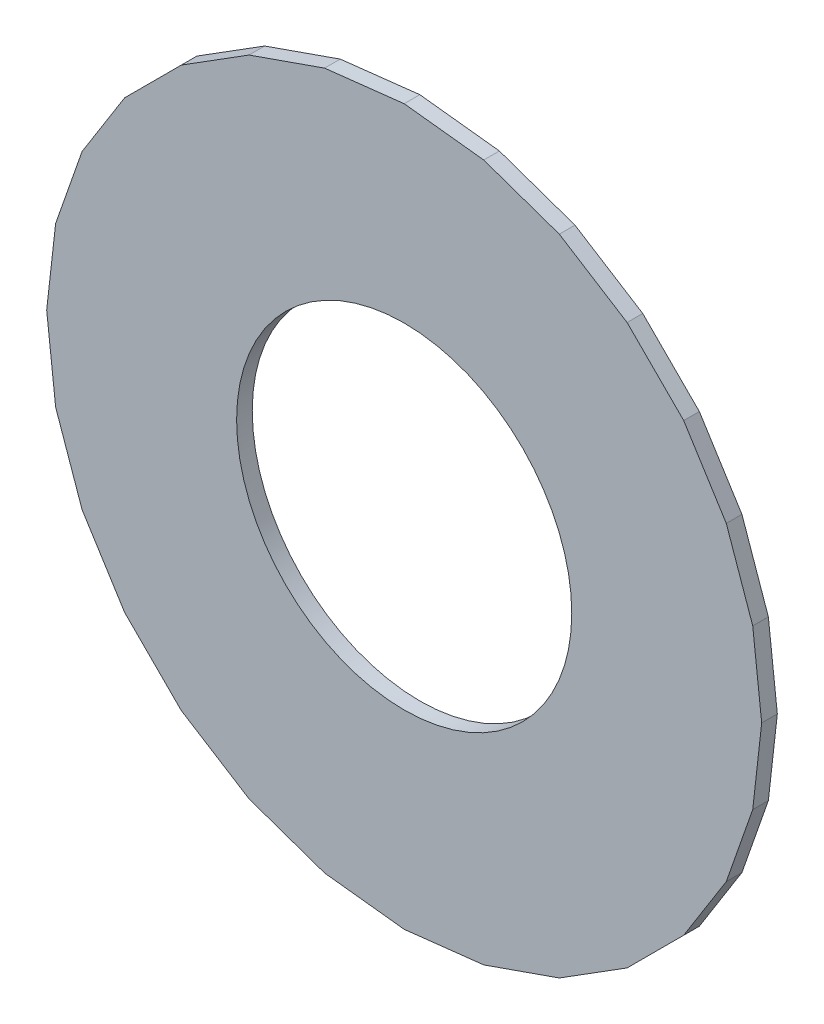
ISO-10303-21;
HEADER;
FILE_DESCRIPTION(('STEP AP214'),'2;1');
FILE_NAME('part.step','',(''),(''),'','','');
FILE_SCHEMA(('AUTOMOTIVE_DESIGN { 1 0 10303 214 1 1 1 1 }'));
ENDSEC;
DATA;
#1=APPLICATION_CONTEXT('core data for automotive mechanical design processes');
#2=APPLICATION_PROTOCOL_DEFINITION('international standard','automotive_design',2000,#1);
#3=PRODUCT_CONTEXT('',#1,'mechanical');
#4=PRODUCT('Part','Part','',(#3));
#5=PRODUCT_RELATED_PRODUCT_CATEGORY('part','',(#4));
#6=PRODUCT_DEFINITION_FORMATION('','',#4);
#7=PRODUCT_DEFINITION_CONTEXT('part definition',#1,'design');
#8=PRODUCT_DEFINITION('design','',#6,#7);
#9=PRODUCT_DEFINITION_SHAPE('','',#8);
#10=(LENGTH_UNIT() NAMED_UNIT(*) SI_UNIT(.MILLI.,.METRE.));
#11=(NAMED_UNIT(*) PLANE_ANGLE_UNIT() SI_UNIT($,.RADIAN.));
#12=(NAMED_UNIT(*) SI_UNIT($,.STERADIAN.) SOLID_ANGLE_UNIT());
#13=UNCERTAINTY_MEASURE_WITH_UNIT(LENGTH_MEASURE(1.E-05),#10,'distance_accuracy_value','');
#14=(GEOMETRIC_REPRESENTATION_CONTEXT(3) GLOBAL_UNCERTAINTY_ASSIGNED_CONTEXT((#13)) GLOBAL_UNIT_ASSIGNED_CONTEXT((#10,
#11,#12)) REPRESENTATION_CONTEXT('',''));
#15=CARTESIAN_POINT('',(0.,0.,0.));
#16=DIRECTION('',(0.,0.,1.));
#17=DIRECTION('',(1.,0.,0.));
#18=AXIS2_PLACEMENT_3D('',#15,#16,#17);
#19=CARTESIAN_POINT('',(117.856,-127.896,-0.045));
#20=DIRECTION('',(0.,0.,-1.));
#21=DIRECTION('',(0.,-1.,0.));
#22=AXIS2_PLACEMENT_3D('',#19,#20,#21);
#23=CYLINDRICAL_SURFACE('',#22,0.375);
#24=CARTESIAN_POINT('',(117.856,-127.896,-0.035));
#25=DIRECTION('',(0.,0.,-1.));
#26=DIRECTION('',(0.,-1.,0.));
#27=AXIS2_PLACEMENT_3D('',#24,#25,#26);
#28=CIRCLE('',#27,0.375);
#29=CARTESIAN_POINT('',(117.856,-128.271,-0.035));
#30=VERTEX_POINT('',#29);
#31=EDGE_CURVE('E385',#30,#30,#28,.T.);
#32=ORIENTED_EDGE('',*,*,#31,.T.);
#33=DIRECTION('',(0.,0.,1.));
#34=VECTOR('',#33,1.);
#35=CARTESIAN_POINT('',(117.856,-128.271,-0.045));
#36=LINE('',#35,#34);
#37=CARTESIAN_POINT('',(117.856,-128.271,0.));
#38=VERTEX_POINT('',#37);
#39=EDGE_CURVE('E11',#30,#38,#36,.T.);
#40=ORIENTED_EDGE('',*,*,#39,.T.);
#41=CARTESIAN_POINT('',(117.856,-127.896,0.));
#42=DIRECTION('',(0.,0.,-1.));
#43=DIRECTION('',(0.,-1.,0.));
#44=AXIS2_PLACEMENT_3D('',#41,#42,#43);
#45=CIRCLE('',#44,0.375);
#46=EDGE_CURVE('E306',#38,#38,#45,.T.);
#47=ORIENTED_EDGE('',*,*,#46,.F.);
#48=ORIENTED_EDGE('',*,*,#39,.F.);
#49=EDGE_LOOP('',(#32,#40,#47,#48));
#50=FACE_BOUND('',#49,.T.);
#51=ADVANCED_FACE('F17',(#50),#23,.F.);
#52=CARTESIAN_POINT('',(117.677983,-128.675942,-0.035));
#53=DIRECTION('',(-0.330278315977027,-0.943883591337077,0.));
#54=DIRECTION('',(-0.943883591337077,0.330278315977027,0.));
#55=AXIS2_PLACEMENT_3D('',#52,#53,#54);
#56=PLANE('',#55);
#57=DIRECTION('',(0.,0.,1.));
#58=VECTOR('',#57,1.);
#59=CARTESIAN_POINT('',(117.677983,-128.675942,-0.035));
#60=LINE('',#59,#58);
#61=CARTESIAN_POINT('',(117.677983,-128.675942,-0.035));
#62=VERTEX_POINT('',#61);
#63=CARTESIAN_POINT('',(117.677983,-128.675942,0.));
#64=VERTEX_POINT('',#63);
#65=EDGE_CURVE('E21',#62,#64,#60,.T.);
#66=ORIENTED_EDGE('',*,*,#65,.T.);
#67=DIRECTION('',(-0.943883591337077,0.330278315977027,0.));
#68=VECTOR('',#67,1.);
#69=CARTESIAN_POINT('',(117.677983,-128.675942,0.));
#70=LINE('',#69,#68);
#71=CARTESIAN_POINT('',(117.508893,-128.616775,0.));
#72=VERTEX_POINT('',#71);
#73=EDGE_CURVE('E460',#64,#72,#70,.T.);
#74=ORIENTED_EDGE('',*,*,#73,.T.);
#75=DIRECTION('',(0.,0.,1.));
#76=VECTOR('',#75,1.);
#77=CARTESIAN_POINT('',(117.508893,-128.616775,-0.035));
#78=LINE('',#77,#76);
#79=CARTESIAN_POINT('',(117.508893,-128.616775,-0.035));
#80=VERTEX_POINT('',#79);
#81=EDGE_CURVE('E341',#80,#72,#78,.T.);
#82=ORIENTED_EDGE('',*,*,#81,.F.);
#83=DIRECTION('',(-0.943883591337077,0.330278315977027,0.));
#84=VECTOR('',#83,1.);
#85=CARTESIAN_POINT('',(117.677983,-128.675942,-0.035));
#86=LINE('',#85,#84);
#87=EDGE_CURVE('E365',#62,#80,#86,.T.);
#88=ORIENTED_EDGE('',*,*,#87,.F.);
#89=EDGE_LOOP('',(#66,#74,#82,#88));
#90=FACE_BOUND('',#89,.T.);
#91=ADVANCED_FACE('F19',(#90),#56,.T.);
#92=CARTESIAN_POINT('',(117.856,-128.696,-0.035));
#93=DIRECTION('',(-0.111966136678988,-0.993712022789894,0.));
#94=DIRECTION('',(-0.993712022789894,0.111966136678988,0.));
#95=AXIS2_PLACEMENT_3D('',#92,#93,#94);
#96=PLANE('',#95);
#97=DIRECTION('',(0.,0.,1.));
#98=VECTOR('',#97,1.);
#99=CARTESIAN_POINT('',(117.856,-128.696,-0.035));
#100=LINE('',#99,#98);
#101=CARTESIAN_POINT('',(117.856,-128.696,-0.035));
#102=VERTEX_POINT('',#101);
#103=CARTESIAN_POINT('',(117.856,-128.696,0.));
#104=VERTEX_POINT('',#103);
#105=EDGE_CURVE('E343',#102,#104,#100,.T.);
#106=ORIENTED_EDGE('',*,*,#105,.T.);
#107=DIRECTION('',(-0.993712022789894,0.111966136678988,0.));
#108=VECTOR('',#107,1.);
#109=CARTESIAN_POINT('',(117.856,-128.696,0.));
#110=LINE('',#109,#108);
#111=EDGE_CURVE('E462',#104,#64,#110,.T.);
#112=ORIENTED_EDGE('',*,*,#111,.T.);
#113=ORIENTED_EDGE('',*,*,#65,.F.);
#114=DIRECTION('',(-0.993712022789894,0.111966136678988,0.));
#115=VECTOR('',#114,1.);
#116=CARTESIAN_POINT('',(117.856,-128.696,-0.035));
#117=LINE('',#116,#115);
#118=EDGE_CURVE('E483',#102,#62,#117,.T.);
#119=ORIENTED_EDGE('',*,*,#118,.F.);
#120=EDGE_LOOP('',(#106,#112,#113,#119));
#121=FACE_BOUND('',#120,.T.);
#122=ADVANCED_FACE('F482',(#121),#96,.T.);
#123=CARTESIAN_POINT('',(117.508893,-128.616775,-0.035));
#124=DIRECTION('',(-0.532032066600227,-0.846724205458361,0.));
#125=DIRECTION('',(-0.846724205458361,0.532032066600227,0.));
#126=AXIS2_PLACEMENT_3D('',#123,#124,#125);
#127=PLANE('',#126);
#128=ORIENTED_EDGE('',*,*,#81,.T.);
#129=DIRECTION('',(-0.846724205458361,0.532032066600227,0.));
#130=VECTOR('',#129,1.);
#131=CARTESIAN_POINT('',(117.508893,-128.616775,0.));
#132=LINE('',#131,#130);
#133=CARTESIAN_POINT('',(117.357208,-128.521465,0.));
#134=VERTEX_POINT('',#133);
#135=EDGE_CURVE('E457',#72,#134,#132,.T.);
#136=ORIENTED_EDGE('',*,*,#135,.T.);
#137=DIRECTION('',(0.,0.,1.));
#138=VECTOR('',#137,1.);
#139=CARTESIAN_POINT('',(117.357208,-128.521465,-0.035));
#140=LINE('',#139,#138);
#141=CARTESIAN_POINT('',(117.357208,-128.521465,-0.035));
#142=VERTEX_POINT('',#141);
#143=EDGE_CURVE('E352',#142,#134,#140,.T.);
#144=ORIENTED_EDGE('',*,*,#143,.F.);
#145=DIRECTION('',(-0.846724205458361,0.532032066600227,0.));
#146=VECTOR('',#145,1.);
#147=CARTESIAN_POINT('',(117.508893,-128.616775,-0.035));
#148=LINE('',#147,#146);
#149=EDGE_CURVE('E373',#80,#142,#148,.T.);
#150=ORIENTED_EDGE('',*,*,#149,.F.);
#151=EDGE_LOOP('',(#128,#136,#144,#150));
#152=FACE_BOUND('',#151,.T.);
#153=ADVANCED_FACE('F673',(#152),#127,.T.);
#154=CARTESIAN_POINT('',(118.034017,-128.675942,-0.035));
#155=DIRECTION('',(0.111966136678988,-0.993712022789894,0.));
#156=DIRECTION('',(0.,0.,-1.));
#157=AXIS2_PLACEMENT_3D('',#154,#155,#156);
#158=PLANE('',#157);
#159=DIRECTION('',(0.,0.,1.));
#160=VECTOR('',#159,1.);
#161=CARTESIAN_POINT('',(118.034017,-128.675942,-0.035));
#162=LINE('',#161,#160);
#163=CARTESIAN_POINT('',(118.034017,-128.675942,-0.035));
#164=VERTEX_POINT('',#163);
#165=CARTESIAN_POINT('',(118.034017,-128.675942,0.));
#166=VERTEX_POINT('',#165);
#167=EDGE_CURVE('E361',#164,#166,#162,.T.);
#168=ORIENTED_EDGE('',*,*,#167,.T.);
#169=DIRECTION('',(-0.993712022789894,-0.111966136678988,0.));
#170=VECTOR('',#169,1.);
#171=CARTESIAN_POINT('',(118.034017,-128.675942,0.));
#172=LINE('',#171,#170);
#173=EDGE_CURVE('E282',#166,#104,#172,.T.);
#174=ORIENTED_EDGE('',*,*,#173,.T.);
#175=ORIENTED_EDGE('',*,*,#105,.F.);
#176=DIRECTION('',(-0.993712022789894,-0.111966136678988,0.));
#177=VECTOR('',#176,1.);
#178=CARTESIAN_POINT('',(118.034017,-128.675942,-0.035));
#179=LINE('',#178,#177);
#180=EDGE_CURVE('E487',#164,#102,#179,.T.);
#181=ORIENTED_EDGE('',*,*,#180,.F.);
#182=EDGE_LOOP('',(#168,#174,#175,#181));
#183=FACE_BOUND('',#182,.T.);
#184=ADVANCED_FACE('F473',(#183),#158,.T.);
#185=CARTESIAN_POINT('',(117.357208,-128.521465,-0.035));
#186=DIRECTION('',(-0.707106781186548,-0.707106781186548,0.));
#187=DIRECTION('',(-0.707106781186548,0.707106781186548,0.));
#188=AXIS2_PLACEMENT_3D('',#185,#186,#187);
#189=PLANE('',#188);
#190=ORIENTED_EDGE('',*,*,#143,.T.);
#191=DIRECTION('',(-0.707106781186548,0.707106781186548,0.));
#192=VECTOR('',#191,1.);
#193=CARTESIAN_POINT('',(117.357208,-128.521465,0.));
#194=LINE('',#193,#192);
#195=CARTESIAN_POINT('',(117.230535,-128.394792,0.));
#196=VERTEX_POINT('',#195);
#197=EDGE_CURVE('E434',#134,#196,#194,.T.);
#198=ORIENTED_EDGE('',*,*,#197,.T.);
#199=DIRECTION('',(0.,0.,1.));
#200=VECTOR('',#199,1.);
#201=CARTESIAN_POINT('',(117.230535,-128.394792,-0.035));
#202=LINE('',#201,#200);
#203=CARTESIAN_POINT('',(117.230535,-128.394792,-0.035));
#204=VERTEX_POINT('',#203);
#205=EDGE_CURVE('E394',#204,#196,#202,.T.);
#206=ORIENTED_EDGE('',*,*,#205,.F.);
#207=DIRECTION('',(-0.707106781186548,0.707106781186548,0.));
#208=VECTOR('',#207,1.);
#209=CARTESIAN_POINT('',(117.357208,-128.521465,-0.035));
#210=LINE('',#209,#208);
#211=EDGE_CURVE('E377',#142,#204,#210,.T.);
#212=ORIENTED_EDGE('',*,*,#211,.F.);
#213=EDGE_LOOP('',(#190,#198,#206,#212));
#214=FACE_BOUND('',#213,.T.);
#215=ADVANCED_FACE('F684',(#214),#189,.T.);
#216=CARTESIAN_POINT('',(118.203107,-128.616775,-0.035));
#217=DIRECTION('',(0.330278315977027,-0.943883591337077,0.));
#218=DIRECTION('',(0.,0.,-1.));
#219=AXIS2_PLACEMENT_3D('',#216,#217,#218);
#220=PLANE('',#219);
#221=DIRECTION('',(0.,0.,1.));
#222=VECTOR('',#221,1.);
#223=CARTESIAN_POINT('',(118.203107,-128.616775,-0.035));
#224=LINE('',#223,#222);
#225=CARTESIAN_POINT('',(118.203107,-128.616775,-0.035));
#226=VERTEX_POINT('',#225);
#227=CARTESIAN_POINT('',(118.203107,-128.616775,0.));
#228=VERTEX_POINT('',#227);
#229=EDGE_CURVE('E391',#226,#228,#224,.T.);
#230=ORIENTED_EDGE('',*,*,#229,.T.);
#231=DIRECTION('',(-0.943883591337077,-0.330278315977027,0.));
#232=VECTOR('',#231,1.);
#233=CARTESIAN_POINT('',(118.203107,-128.616775,0.));
#234=LINE('',#233,#232);
#235=EDGE_CURVE('E284',#228,#166,#234,.T.);
#236=ORIENTED_EDGE('',*,*,#235,.T.);
#237=ORIENTED_EDGE('',*,*,#167,.F.);
#238=DIRECTION('',(-0.943883591337077,-0.330278315977027,0.));
#239=VECTOR('',#238,1.);
#240=CARTESIAN_POINT('',(118.203107,-128.616775,-0.035));
#241=LINE('',#240,#239);
#242=EDGE_CURVE('E493',#226,#164,#241,.T.);
#243=ORIENTED_EDGE('',*,*,#242,.F.);
#244=EDGE_LOOP('',(#230,#236,#237,#243));
#245=FACE_BOUND('',#244,.T.);
#246=ADVANCED_FACE('F635',(#245),#220,.T.);
#247=CARTESIAN_POINT('',(117.230535,-128.394792,-0.035));
#248=DIRECTION('',(-0.846724205458361,-0.532032066600227,0.));
#249=DIRECTION('',(-0.532032066600227,0.846724205458361,0.));
#250=AXIS2_PLACEMENT_3D('',#247,#248,#249);
#251=PLANE('',#250);
#252=ORIENTED_EDGE('',*,*,#205,.T.);
#253=DIRECTION('',(-0.532032066600227,0.846724205458361,0.));
#254=VECTOR('',#253,1.);
#255=CARTESIAN_POINT('',(117.230535,-128.394792,0.));
#256=LINE('',#255,#254);
#257=CARTESIAN_POINT('',(117.135225,-128.243107,0.));
#258=VERTEX_POINT('',#257);
#259=EDGE_CURVE('E430',#196,#258,#256,.T.);
#260=ORIENTED_EDGE('',*,*,#259,.T.);
#261=DIRECTION('',(0.,0.,1.));
#262=VECTOR('',#261,1.);
#263=CARTESIAN_POINT('',(117.135225,-128.243107,-0.035));
#264=LINE('',#263,#262);
#265=CARTESIAN_POINT('',(117.135225,-128.243107,-0.035));
#266=VERTEX_POINT('',#265);
#267=EDGE_CURVE('E331',#266,#258,#264,.T.);
#268=ORIENTED_EDGE('',*,*,#267,.F.);
#269=DIRECTION('',(-0.532032066600227,0.846724205458361,0.));
#270=VECTOR('',#269,1.);
#271=CARTESIAN_POINT('',(117.230535,-128.394792,-0.035));
#272=LINE('',#271,#270);
#273=EDGE_CURVE('E390',#204,#266,#272,.T.);
#274=ORIENTED_EDGE('',*,*,#273,.F.);
#275=EDGE_LOOP('',(#252,#260,#268,#274));
#276=FACE_BOUND('',#275,.T.);
#277=ADVANCED_FACE('F697',(#276),#251,.T.);
#278=CARTESIAN_POINT('',(118.354792,-128.521465,-0.035));
#279=DIRECTION('',(0.532032066600227,-0.846724205458361,0.));
#280=DIRECTION('',(0.,0.,-1.));
#281=AXIS2_PLACEMENT_3D('',#278,#279,#280);
#282=PLANE('',#281);
#283=DIRECTION('',(0.,0.,1.));
#284=VECTOR('',#283,1.);
#285=CARTESIAN_POINT('',(118.354792,-128.521465,-0.035));
#286=LINE('',#285,#284);
#287=CARTESIAN_POINT('',(118.354792,-128.521465,-0.035));
#288=VERTEX_POINT('',#287);
#289=CARTESIAN_POINT('',(118.354792,-128.521465,0.));
#290=VERTEX_POINT('',#289);
#291=EDGE_CURVE('E327',#288,#290,#286,.T.);
#292=ORIENTED_EDGE('',*,*,#291,.T.);
#293=DIRECTION('',(-0.846724205458361,-0.532032066600227,0.));
#294=VECTOR('',#293,1.);
#295=CARTESIAN_POINT('',(118.354792,-128.521465,0.));
#296=LINE('',#295,#294);
#297=EDGE_CURVE('E288',#290,#228,#296,.T.);
#298=ORIENTED_EDGE('',*,*,#297,.T.);
#299=ORIENTED_EDGE('',*,*,#229,.F.);
#300=DIRECTION('',(-0.846724205458361,-0.532032066600227,0.));
#301=VECTOR('',#300,1.);
#302=CARTESIAN_POINT('',(118.354792,-128.521465,-0.035));
#303=LINE('',#302,#301);
#304=EDGE_CURVE('E499',#288,#226,#303,.T.);
#305=ORIENTED_EDGE('',*,*,#304,.F.);
#306=EDGE_LOOP('',(#292,#298,#299,#305));
#307=FACE_BOUND('',#306,.T.);
#308=ADVANCED_FACE('F633',(#307),#282,.T.);
#309=CARTESIAN_POINT('',(117.135225,-128.243107,-0.035));
#310=DIRECTION('',(-0.943883591337077,-0.330278315977027,0.));
#311=DIRECTION('',(-0.330278315977027,0.943883591337077,0.));
#312=AXIS2_PLACEMENT_3D('',#309,#310,#311);
#313=PLANE('',#312);
#314=ORIENTED_EDGE('',*,*,#267,.T.);
#315=DIRECTION('',(-0.330278315977027,0.943883591337077,0.));
#316=VECTOR('',#315,1.);
#317=CARTESIAN_POINT('',(117.135225,-128.243107,0.));
#318=LINE('',#317,#316);
#319=CARTESIAN_POINT('',(117.076058,-128.074017,0.));
#320=VERTEX_POINT('',#319);
#321=EDGE_CURVE('E435',#258,#320,#318,.T.);
#322=ORIENTED_EDGE('',*,*,#321,.T.);
#323=DIRECTION('',(0.,0.,1.));
#324=VECTOR('',#323,1.);
#325=CARTESIAN_POINT('',(117.076058,-128.074017,-0.035));
#326=LINE('',#325,#324);
#327=CARTESIAN_POINT('',(117.076058,-128.074017,-0.035));
#328=VERTEX_POINT('',#327);
#329=EDGE_CURVE('E310',#328,#320,#326,.T.);
#330=ORIENTED_EDGE('',*,*,#329,.F.);
#331=DIRECTION('',(-0.330278315977027,0.943883591337077,0.));
#332=VECTOR('',#331,1.);
#333=CARTESIAN_POINT('',(117.135225,-128.243107,-0.035));
#334=LINE('',#333,#332);
#335=EDGE_CURVE('E398',#266,#328,#334,.T.);
#336=ORIENTED_EDGE('',*,*,#335,.F.);
#337=EDGE_LOOP('',(#314,#322,#330,#336));
#338=FACE_BOUND('',#337,.T.);
#339=ADVANCED_FACE('F713',(#338),#313,.T.);
#340=CARTESIAN_POINT('',(118.481465,-128.394792,-0.035));
#341=DIRECTION('',(0.707106781186548,-0.707106781186548,0.));
#342=DIRECTION('',(0.,0.,-1.));
#343=AXIS2_PLACEMENT_3D('',#340,#341,#342);
#344=PLANE('',#343);
#345=DIRECTION('',(0.,0.,1.));
#346=VECTOR('',#345,1.);
#347=CARTESIAN_POINT('',(118.481465,-128.394792,-0.035));
#348=LINE('',#347,#346);
#349=CARTESIAN_POINT('',(118.481465,-128.394792,-0.035));
#350=VERTEX_POINT('',#349);
#351=CARTESIAN_POINT('',(118.481465,-128.394792,0.));
#352=VERTEX_POINT('',#351);
#353=EDGE_CURVE('E307',#350,#352,#348,.T.);
#354=ORIENTED_EDGE('',*,*,#353,.T.);
#355=DIRECTION('',(-0.707106781186548,-0.707106781186548,0.));
#356=VECTOR('',#355,1.);
#357=CARTESIAN_POINT('',(118.481465,-128.394792,0.));
#358=LINE('',#357,#356);
#359=EDGE_CURVE('E293',#352,#290,#358,.T.);
#360=ORIENTED_EDGE('',*,*,#359,.T.);
#361=ORIENTED_EDGE('',*,*,#291,.F.);
#362=DIRECTION('',(-0.707106781186548,-0.707106781186548,0.));
#363=VECTOR('',#362,1.);
#364=CARTESIAN_POINT('',(118.481465,-128.394792,-0.035));
#365=LINE('',#364,#363);
#366=EDGE_CURVE('E504',#350,#288,#365,.T.);
#367=ORIENTED_EDGE('',*,*,#366,.F.);
#368=EDGE_LOOP('',(#354,#360,#361,#367));
#369=FACE_BOUND('',#368,.T.);
#370=ADVANCED_FACE('F629',(#369),#344,.T.);
#371=CARTESIAN_POINT('',(117.076058,-128.074017,-0.035));
#372=DIRECTION('',(-0.993712022789894,-0.111966136678988,0.));
#373=DIRECTION('',(-0.111966136678988,0.993712022789894,0.));
#374=AXIS2_PLACEMENT_3D('',#371,#372,#373);
#375=PLANE('',#374);
#376=ORIENTED_EDGE('',*,*,#329,.T.);
#377=DIRECTION('',(-0.111966136678988,0.993712022789894,0.));
#378=VECTOR('',#377,1.);
#379=CARTESIAN_POINT('',(117.076058,-128.074017,0.));
#380=LINE('',#379,#378);
#381=CARTESIAN_POINT('',(117.056,-127.896,0.));
#382=VERTEX_POINT('',#381);
#383=EDGE_CURVE('E371',#320,#382,#380,.T.);
#384=ORIENTED_EDGE('',*,*,#383,.T.);
#385=DIRECTION('',(0.,0.,1.));
#386=VECTOR('',#385,1.);
#387=CARTESIAN_POINT('',(117.056,-127.896,-0.035));
#388=LINE('',#387,#386);
#389=CARTESIAN_POINT('',(117.056,-127.896,-0.035));
#390=VERTEX_POINT('',#389);
#391=EDGE_CURVE('E311',#390,#382,#388,.T.);
#392=ORIENTED_EDGE('',*,*,#391,.F.);
#393=DIRECTION('',(-0.111966136678988,0.993712022789894,0.));
#394=VECTOR('',#393,1.);
#395=CARTESIAN_POINT('',(117.076058,-128.074017,-0.035));
#396=LINE('',#395,#394);
#397=EDGE_CURVE('E399',#328,#390,#396,.T.);
#398=ORIENTED_EDGE('',*,*,#397,.F.);
#399=EDGE_LOOP('',(#376,#384,#392,#398));
#400=FACE_BOUND('',#399,.T.);
#401=ADVANCED_FACE('F729',(#400),#375,.T.);
#402=CARTESIAN_POINT('',(118.576775,-128.243107,-0.035));
#403=DIRECTION('',(0.846724205458361,-0.532032066600227,0.));
#404=DIRECTION('',(0.,0.,-1.));
#405=AXIS2_PLACEMENT_3D('',#402,#403,#404);
#406=PLANE('',#405);
#407=DIRECTION('',(0.,0.,1.));
#408=VECTOR('',#407,1.);
#409=CARTESIAN_POINT('',(118.576775,-128.243107,-0.035));
#410=LINE('',#409,#408);
#411=CARTESIAN_POINT('',(118.576775,-128.243107,-0.035));
#412=VERTEX_POINT('',#411);
#413=CARTESIAN_POINT('',(118.576775,-128.243107,0.));
#414=VERTEX_POINT('',#413);
#415=EDGE_CURVE('E340',#412,#414,#410,.T.);
#416=ORIENTED_EDGE('',*,*,#415,.T.);
#417=DIRECTION('',(-0.532032066600227,-0.846724205458361,0.));
#418=VECTOR('',#417,1.);
#419=CARTESIAN_POINT('',(118.576775,-128.243107,0.));
#420=LINE('',#419,#418);
#421=EDGE_CURVE('E289',#414,#352,#420,.T.);
#422=ORIENTED_EDGE('',*,*,#421,.T.);
#423=ORIENTED_EDGE('',*,*,#353,.F.);
#424=DIRECTION('',(-0.532032066600227,-0.846724205458361,0.));
#425=VECTOR('',#424,1.);
#426=CARTESIAN_POINT('',(118.576775,-128.243107,-0.035));
#427=LINE('',#426,#425);
#428=EDGE_CURVE('E508',#412,#350,#427,.T.);
#429=ORIENTED_EDGE('',*,*,#428,.F.);
#430=EDGE_LOOP('',(#416,#422,#423,#429));
#431=FACE_BOUND('',#430,.T.);
#432=ADVANCED_FACE('F625',(#431),#406,.T.);
#433=CARTESIAN_POINT('',(117.056,-127.896,-0.035));
#434=DIRECTION('',(-0.993712022789894,0.111966136678988,0.));
#435=DIRECTION('',(0.,0.,1.));
#436=AXIS2_PLACEMENT_3D('',#433,#434,#435);
#437=PLANE('',#436);
#438=ORIENTED_EDGE('',*,*,#391,.T.);
#439=DIRECTION('',(0.111966136678988,0.993712022789894,0.));
#440=VECTOR('',#439,1.);
#441=CARTESIAN_POINT('',(117.056,-127.896,0.));
#442=LINE('',#441,#440);
#443=CARTESIAN_POINT('',(117.076058,-127.717983,0.));
#444=VERTEX_POINT('',#443);
#445=EDGE_CURVE('E367',#382,#444,#442,.T.);
#446=ORIENTED_EDGE('',*,*,#445,.T.);
#447=DIRECTION('',(0.,0.,1.));
#448=VECTOR('',#447,1.);
#449=CARTESIAN_POINT('',(117.076058,-127.717983,-0.035));
#450=LINE('',#449,#448);
#451=CARTESIAN_POINT('',(117.076058,-127.717983,-0.035));
#452=VERTEX_POINT('',#451);
#453=EDGE_CURVE('E338',#452,#444,#450,.T.);
#454=ORIENTED_EDGE('',*,*,#453,.F.);
#455=DIRECTION('',(0.111966136678988,0.993712022789894,0.));
#456=VECTOR('',#455,1.);
#457=CARTESIAN_POINT('',(117.056,-127.896,-0.035));
#458=LINE('',#457,#456);
#459=EDGE_CURVE('E403',#390,#452,#458,.T.);
#460=ORIENTED_EDGE('',*,*,#459,.F.);
#461=EDGE_LOOP('',(#438,#446,#454,#460));
#462=FACE_BOUND('',#461,.T.);
#463=ADVANCED_FACE('F745',(#462),#437,.T.);
#464=CARTESIAN_POINT('',(118.635942,-128.074017,-0.035));
#465=DIRECTION('',(0.943883591337077,-0.330278315977027,0.));
#466=DIRECTION('',(0.,0.,-1.));
#467=AXIS2_PLACEMENT_3D('',#464,#465,#466);
#468=PLANE('',#467);
#469=DIRECTION('',(0.,0.,1.));
#470=VECTOR('',#469,1.);
#471=CARTESIAN_POINT('',(118.635942,-128.074017,-0.035));
#472=LINE('',#471,#470);
#473=CARTESIAN_POINT('',(118.635942,-128.074017,-0.035));
#474=VERTEX_POINT('',#473);
#475=CARTESIAN_POINT('',(118.635942,-128.074017,0.));
#476=VERTEX_POINT('',#475);
#477=EDGE_CURVE('E335',#474,#476,#472,.T.);
#478=ORIENTED_EDGE('',*,*,#477,.T.);
#479=DIRECTION('',(-0.330278315977027,-0.943883591337077,0.));
#480=VECTOR('',#479,1.);
#481=CARTESIAN_POINT('',(118.635942,-128.074017,0.));
#482=LINE('',#481,#480);
#483=EDGE_CURVE('E278',#476,#414,#482,.T.);
#484=ORIENTED_EDGE('',*,*,#483,.T.);
#485=ORIENTED_EDGE('',*,*,#415,.F.);
#486=DIRECTION('',(-0.330278315977027,-0.943883591337077,0.));
#487=VECTOR('',#486,1.);
#488=CARTESIAN_POINT('',(118.635942,-128.074017,-0.035));
#489=LINE('',#488,#487);
#490=EDGE_CURVE('E514',#474,#412,#489,.T.);
#491=ORIENTED_EDGE('',*,*,#490,.F.);
#492=EDGE_LOOP('',(#478,#484,#485,#491));
#493=FACE_BOUND('',#492,.T.);
#494=ADVANCED_FACE('F622',(#493),#468,.T.);
#495=CARTESIAN_POINT('',(117.076058,-127.717983,-0.035));
#496=DIRECTION('',(-0.943883591337077,0.330278315977027,0.));
#497=DIRECTION('',(0.,0.,1.));
#498=AXIS2_PLACEMENT_3D('',#495,#496,#497);
#499=PLANE('',#498);
#500=ORIENTED_EDGE('',*,*,#453,.T.);
#501=DIRECTION('',(0.330278315977027,0.943883591337077,0.));
#502=VECTOR('',#501,1.);
#503=CARTESIAN_POINT('',(117.076058,-127.717983,0.));
#504=LINE('',#503,#502);
#505=CARTESIAN_POINT('',(117.135225,-127.548893,0.));
#506=VERTEX_POINT('',#505);
#507=EDGE_CURVE('E372',#444,#506,#504,.T.);
#508=ORIENTED_EDGE('',*,*,#507,.T.);
#509=DIRECTION('',(0.,0.,1.));
#510=VECTOR('',#509,1.);
#511=CARTESIAN_POINT('',(117.135225,-127.548893,-0.035));
#512=LINE('',#511,#510);
#513=CARTESIAN_POINT('',(117.135225,-127.548893,-0.035));
#514=VERTEX_POINT('',#513);
#515=EDGE_CURVE('E332',#514,#506,#512,.T.);
#516=ORIENTED_EDGE('',*,*,#515,.F.);
#517=DIRECTION('',(0.330278315977027,0.943883591337077,0.));
#518=VECTOR('',#517,1.);
#519=CARTESIAN_POINT('',(117.076058,-127.717983,-0.035));
#520=LINE('',#519,#518);
#521=EDGE_CURVE('E552',#452,#514,#520,.T.);
#522=ORIENTED_EDGE('',*,*,#521,.F.);
#523=EDGE_LOOP('',(#500,#508,#516,#522));
#524=FACE_BOUND('',#523,.T.);
#525=ADVANCED_FACE('F761',(#524),#499,.T.);
#526=CARTESIAN_POINT('',(118.656,-127.896,-0.035));
#527=DIRECTION('',(0.993712022789894,-0.111966136678988,0.));
#528=DIRECTION('',(0.,0.,-1.));
#529=AXIS2_PLACEMENT_3D('',#526,#527,#528);
#530=PLANE('',#529);
#531=DIRECTION('',(0.,0.,1.));
#532=VECTOR('',#531,1.);
#533=CARTESIAN_POINT('',(118.656,-127.896,-0.035));
#534=LINE('',#533,#532);
#535=CARTESIAN_POINT('',(118.656,-127.896,-0.035));
#536=VERTEX_POINT('',#535);
#537=CARTESIAN_POINT('',(118.656,-127.896,0.));
#538=VERTEX_POINT('',#537);
#539=EDGE_CURVE('E326',#536,#538,#534,.T.);
#540=ORIENTED_EDGE('',*,*,#539,.T.);
#541=DIRECTION('',(-0.111966136678988,-0.993712022789894,0.));
#542=VECTOR('',#541,1.);
#543=CARTESIAN_POINT('',(118.656,-127.896,0.));
#544=LINE('',#543,#542);
#545=EDGE_CURVE('E271',#538,#476,#544,.T.);
#546=ORIENTED_EDGE('',*,*,#545,.T.);
#547=ORIENTED_EDGE('',*,*,#477,.F.);
#548=DIRECTION('',(-0.111966136678988,-0.993712022789894,0.));
#549=VECTOR('',#548,1.);
#550=CARTESIAN_POINT('',(118.656,-127.896,-0.035));
#551=LINE('',#550,#549);
#552=EDGE_CURVE('E517',#536,#474,#551,.T.);
#553=ORIENTED_EDGE('',*,*,#552,.F.);
#554=EDGE_LOOP('',(#540,#546,#547,#553));
#555=FACE_BOUND('',#554,.T.);
#556=ADVANCED_FACE('F793',(#555),#530,.T.);
#557=CARTESIAN_POINT('',(117.135225,-127.548893,-0.035));
#558=DIRECTION('',(-0.846724205458361,0.532032066600227,0.));
#559=DIRECTION('',(0.,0.,1.));
#560=AXIS2_PLACEMENT_3D('',#557,#558,#559);
#561=PLANE('',#560);
#562=ORIENTED_EDGE('',*,*,#515,.T.);
#563=DIRECTION('',(0.532032066600227,0.846724205458361,0.));
#564=VECTOR('',#563,1.);
#565=CARTESIAN_POINT('',(117.135225,-127.548893,0.));
#566=LINE('',#565,#564);
#567=CARTESIAN_POINT('',(117.230535,-127.397208,0.));
#568=VERTEX_POINT('',#567);
#569=EDGE_CURVE('E413',#506,#568,#566,.T.);
#570=ORIENTED_EDGE('',*,*,#569,.T.);
#571=DIRECTION('',(0.,0.,1.));
#572=VECTOR('',#571,1.);
#573=CARTESIAN_POINT('',(117.230535,-127.397208,-0.035));
#574=LINE('',#573,#572);
#575=CARTESIAN_POINT('',(117.230535,-127.397208,-0.035));
#576=VERTEX_POINT('',#575);
#577=EDGE_CURVE('E255',#576,#568,#574,.T.);
#578=ORIENTED_EDGE('',*,*,#577,.F.);
#579=DIRECTION('',(0.532032066600227,0.846724205458361,0.));
#580=VECTOR('',#579,1.);
#581=CARTESIAN_POINT('',(117.135225,-127.548893,-0.035));
#582=LINE('',#581,#580);
#583=EDGE_CURVE('E409',#514,#576,#582,.T.);
#584=ORIENTED_EDGE('',*,*,#583,.F.);
#585=EDGE_LOOP('',(#562,#570,#578,#584));
#586=FACE_BOUND('',#585,.T.);
#587=ADVANCED_FACE('F771',(#586),#561,.T.);
#588=CARTESIAN_POINT('',(118.635942,-127.717983,-0.035));
#589=DIRECTION('',(0.993712022789894,0.111966136678988,0.));
#590=DIRECTION('',(0.,0.,-1.));
#591=AXIS2_PLACEMENT_3D('',#588,#589,#590);
#592=PLANE('',#591);
#593=DIRECTION('',(0.,0.,1.));
#594=VECTOR('',#593,1.);
#595=CARTESIAN_POINT('',(118.635942,-127.717983,-0.035));
#596=LINE('',#595,#594);
#597=CARTESIAN_POINT('',(118.635942,-127.717983,-0.035));
#598=VERTEX_POINT('',#597);
#599=CARTESIAN_POINT('',(118.635942,-127.717983,0.));
#600=VERTEX_POINT('',#599);
#601=EDGE_CURVE('E242',#598,#600,#596,.T.);
#602=ORIENTED_EDGE('',*,*,#601,.T.);
#603=DIRECTION('',(0.111966136678988,-0.993712022789894,0.));
#604=VECTOR('',#603,1.);
#605=CARTESIAN_POINT('',(118.635942,-127.717983,0.));
#606=LINE('',#605,#604);
#607=EDGE_CURVE('E247',#600,#538,#606,.T.);
#608=ORIENTED_EDGE('',*,*,#607,.T.);
#609=ORIENTED_EDGE('',*,*,#539,.F.);
#610=DIRECTION('',(0.111966136678988,-0.993712022789894,0.));
#611=VECTOR('',#610,1.);
#612=CARTESIAN_POINT('',(118.635942,-127.717983,-0.035));
#613=LINE('',#612,#611);
#614=EDGE_CURVE('E250',#598,#536,#613,.T.);
#615=ORIENTED_EDGE('',*,*,#614,.F.);
#616=EDGE_LOOP('',(#602,#608,#609,#615));
#617=FACE_BOUND('',#616,.T.);
#618=ADVANCED_FACE('F244',(#617),#592,.T.);
#619=CARTESIAN_POINT('',(117.230535,-127.397208,-0.035));
#620=DIRECTION('',(-0.707106781186548,0.707106781186548,0.));
#621=DIRECTION('',(0.,0.,1.));
#622=AXIS2_PLACEMENT_3D('',#619,#620,#621);
#623=PLANE('',#622);
#624=ORIENTED_EDGE('',*,*,#577,.T.);
#625=DIRECTION('',(0.707106781186548,0.707106781186548,0.));
#626=VECTOR('',#625,1.);
#627=CARTESIAN_POINT('',(117.230535,-127.397208,0.));
#628=LINE('',#627,#626);
#629=CARTESIAN_POINT('',(117.357208,-127.270535,0.));
#630=VERTEX_POINT('',#629);
#631=EDGE_CURVE('E439',#568,#630,#628,.T.);
#632=ORIENTED_EDGE('',*,*,#631,.T.);
#633=DIRECTION('',(0.,0.,1.));
#634=VECTOR('',#633,1.);
#635=CARTESIAN_POINT('',(117.357208,-127.270535,-0.035));
#636=LINE('',#635,#634);
#637=CARTESIAN_POINT('',(117.357208,-127.270535,-0.035));
#638=VERTEX_POINT('',#637);
#639=EDGE_CURVE('E256',#638,#630,#636,.T.);
#640=ORIENTED_EDGE('',*,*,#639,.F.);
#641=DIRECTION('',(0.707106781186548,0.707106781186548,0.));
#642=VECTOR('',#641,1.);
#643=CARTESIAN_POINT('',(117.230535,-127.397208,-0.035));
#644=LINE('',#643,#642);
#645=EDGE_CURVE('E404',#576,#638,#644,.T.);
#646=ORIENTED_EDGE('',*,*,#645,.F.);
#647=EDGE_LOOP('',(#624,#632,#640,#646));
#648=FACE_BOUND('',#647,.T.);
#649=ADVANCED_FACE('F770',(#648),#623,.T.);
#650=CARTESIAN_POINT('',(118.576775,-127.548893,-0.035));
#651=DIRECTION('',(0.943883591337077,0.330278315977027,0.));
#652=DIRECTION('',(0.,0.,-1.));
#653=AXIS2_PLACEMENT_3D('',#650,#651,#652);
#654=PLANE('',#653);
#655=DIRECTION('',(0.,0.,1.));
#656=VECTOR('',#655,1.);
#657=CARTESIAN_POINT('',(118.576775,-127.548893,-0.035));
#658=LINE('',#657,#656);
#659=CARTESIAN_POINT('',(118.576775,-127.548893,-0.035));
#660=VERTEX_POINT('',#659);
#661=CARTESIAN_POINT('',(118.576775,-127.548893,0.));
#662=VERTEX_POINT('',#661);
#663=EDGE_CURVE('E261',#660,#662,#658,.T.);
#664=ORIENTED_EDGE('',*,*,#663,.T.);
#665=DIRECTION('',(0.330278315977027,-0.943883591337077,0.));
#666=VECTOR('',#665,1.);
#667=CARTESIAN_POINT('',(118.576775,-127.548893,0.));
#668=LINE('',#667,#666);
#669=EDGE_CURVE('E259',#662,#600,#668,.T.);
#670=ORIENTED_EDGE('',*,*,#669,.T.);
#671=ORIENTED_EDGE('',*,*,#601,.F.);
#672=DIRECTION('',(0.330278315977027,-0.943883591337077,0.));
#673=VECTOR('',#672,1.);
#674=CARTESIAN_POINT('',(118.576775,-127.548893,-0.035));
#675=LINE('',#674,#673);
#676=EDGE_CURVE('E523',#660,#598,#675,.T.);
#677=ORIENTED_EDGE('',*,*,#676,.F.);
#678=EDGE_LOOP('',(#664,#670,#671,#677));
#679=FACE_BOUND('',#678,.T.);
#680=ADVANCED_FACE('F260',(#679),#654,.T.);
#681=CARTESIAN_POINT('',(117.357208,-127.270535,-0.035));
#682=DIRECTION('',(-0.532032066600227,0.846724205458361,0.));
#683=DIRECTION('',(0.,0.,1.));
#684=AXIS2_PLACEMENT_3D('',#681,#682,#683);
#685=PLANE('',#684);
#686=ORIENTED_EDGE('',*,*,#639,.T.);
#687=DIRECTION('',(0.846724205458361,0.532032066600227,0.));
#688=VECTOR('',#687,1.);
#689=CARTESIAN_POINT('',(117.357208,-127.270535,0.));
#690=LINE('',#689,#688);
#691=CARTESIAN_POINT('',(117.508893,-127.175225,0.));
#692=VERTEX_POINT('',#691);
#693=EDGE_CURVE('E424',#630,#692,#690,.T.);
#694=ORIENTED_EDGE('',*,*,#693,.T.);
#695=DIRECTION('',(0.,0.,1.));
#696=VECTOR('',#695,1.);
#697=CARTESIAN_POINT('',(117.508893,-127.175225,-0.035));
#698=LINE('',#697,#696);
#699=CARTESIAN_POINT('',(117.508893,-127.175225,-0.035));
#700=VERTEX_POINT('',#699);
#701=EDGE_CURVE('E317',#700,#692,#698,.T.);
#702=ORIENTED_EDGE('',*,*,#701,.F.);
#703=DIRECTION('',(0.846724205458361,0.532032066600227,0.));
#704=VECTOR('',#703,1.);
#705=CARTESIAN_POINT('',(117.357208,-127.270535,-0.035));
#706=LINE('',#705,#704);
#707=EDGE_CURVE('E408',#638,#700,#706,.T.);
#708=ORIENTED_EDGE('',*,*,#707,.F.);
#709=EDGE_LOOP('',(#686,#694,#702,#708));
#710=FACE_BOUND('',#709,.T.);
#711=ADVANCED_FACE('F788',(#710),#685,.T.);
#712=CARTESIAN_POINT('',(118.481465,-127.397208,-0.035));
#713=DIRECTION('',(0.846724205458361,0.532032066600227,0.));
#714=DIRECTION('',(0.,0.,-1.));
#715=AXIS2_PLACEMENT_3D('',#712,#713,#714);
#716=PLANE('',#715);
#717=DIRECTION('',(0.,0.,1.));
#718=VECTOR('',#717,1.);
#719=CARTESIAN_POINT('',(118.481465,-127.397208,-0.035));
#720=LINE('',#719,#718);
#721=CARTESIAN_POINT('',(118.481465,-127.397208,-0.035));
#722=VERTEX_POINT('',#721);
#723=CARTESIAN_POINT('',(118.481465,-127.397208,0.));
#724=VERTEX_POINT('',#723);
#725=EDGE_CURVE('E50',#722,#724,#720,.T.);
#726=ORIENTED_EDGE('',*,*,#725,.T.);
#727=DIRECTION('',(0.532032066600227,-0.846724205458361,0.));
#728=VECTOR('',#727,1.);
#729=CARTESIAN_POINT('',(118.481465,-127.397208,0.));
#730=LINE('',#729,#728);
#731=EDGE_CURVE('E265',#724,#662,#730,.T.);
#732=ORIENTED_EDGE('',*,*,#731,.T.);
#733=ORIENTED_EDGE('',*,*,#663,.F.);
#734=DIRECTION('',(0.532032066600227,-0.846724205458361,0.));
#735=VECTOR('',#734,1.);
#736=CARTESIAN_POINT('',(118.481465,-127.397208,-0.035));
#737=LINE('',#736,#735);
#738=EDGE_CURVE('E548',#722,#660,#737,.T.);
#739=ORIENTED_EDGE('',*,*,#738,.F.);
#740=EDGE_LOOP('',(#726,#732,#733,#739));
#741=FACE_BOUND('',#740,.T.);
#742=ADVANCED_FACE('F605',(#741),#716,.T.);
#743=CARTESIAN_POINT('',(117.508893,-127.175225,-0.035));
#744=DIRECTION('',(-0.330278315977027,0.943883591337077,0.));
#745=DIRECTION('',(0.,0.,1.));
#746=AXIS2_PLACEMENT_3D('',#743,#744,#745);
#747=PLANE('',#746);
#748=ORIENTED_EDGE('',*,*,#701,.T.);
#749=DIRECTION('',(0.943883591337077,0.330278315977027,0.));
#750=VECTOR('',#749,1.);
#751=CARTESIAN_POINT('',(117.508893,-127.175225,0.));
#752=LINE('',#751,#750);
#753=CARTESIAN_POINT('',(117.677983,-127.116058,0.));
#754=VERTEX_POINT('',#753);
#755=EDGE_CURVE('E420',#692,#754,#752,.T.);
#756=ORIENTED_EDGE('',*,*,#755,.T.);
#757=DIRECTION('',(0.,0.,1.));
#758=VECTOR('',#757,1.);
#759=CARTESIAN_POINT('',(117.677983,-127.116058,-0.035));
#760=LINE('',#759,#758);
#761=CARTESIAN_POINT('',(117.677983,-127.116058,-0.035));
#762=VERTEX_POINT('',#761);
#763=EDGE_CURVE('E312',#762,#754,#760,.T.);
#764=ORIENTED_EDGE('',*,*,#763,.F.);
#765=DIRECTION('',(0.943883591337077,0.330278315977027,0.));
#766=VECTOR('',#765,1.);
#767=CARTESIAN_POINT('',(117.508893,-127.175225,-0.035));
#768=LINE('',#767,#766);
#769=EDGE_CURVE('E386',#700,#762,#768,.T.);
#770=ORIENTED_EDGE('',*,*,#769,.F.);
#771=EDGE_LOOP('',(#748,#756,#764,#770));
#772=FACE_BOUND('',#771,.T.);
#773=ADVANCED_FACE('F847',(#772),#747,.T.);
#774=CARTESIAN_POINT('',(118.354792,-127.270535,-0.035));
#775=DIRECTION('',(0.707106781186548,0.707106781186548,0.));
#776=DIRECTION('',(0.,0.,-1.));
#777=AXIS2_PLACEMENT_3D('',#774,#775,#776);
#778=PLANE('',#777);
#779=DIRECTION('',(0.,0.,1.));
#780=VECTOR('',#779,1.);
#781=CARTESIAN_POINT('',(118.354792,-127.270535,-0.035));
#782=LINE('',#781,#780);
#783=CARTESIAN_POINT('',(118.354792,-127.270535,-0.035));
#784=VERTEX_POINT('',#783);
#785=CARTESIAN_POINT('',(118.354792,-127.270535,0.));
#786=VERTEX_POINT('',#785);
#787=EDGE_CURVE('E528',#784,#786,#782,.T.);
#788=ORIENTED_EDGE('',*,*,#787,.T.);
#789=DIRECTION('',(0.707106781186548,-0.707106781186548,0.));
#790=VECTOR('',#789,1.);
#791=CARTESIAN_POINT('',(118.354792,-127.270535,0.));
#792=LINE('',#791,#790);
#793=EDGE_CURVE('E303',#786,#724,#792,.T.);
#794=ORIENTED_EDGE('',*,*,#793,.T.);
#795=ORIENTED_EDGE('',*,*,#725,.F.);
#796=DIRECTION('',(0.707106781186548,-0.707106781186548,0.));
#797=VECTOR('',#796,1.);
#798=CARTESIAN_POINT('',(118.354792,-127.270535,-0.035));
#799=LINE('',#798,#797);
#800=EDGE_CURVE('E537',#784,#722,#799,.T.);
#801=ORIENTED_EDGE('',*,*,#800,.F.);
#802=EDGE_LOOP('',(#788,#794,#795,#801));
#803=FACE_BOUND('',#802,.T.);
#804=ADVANCED_FACE('F603',(#803),#778,.T.);
#805=CARTESIAN_POINT('',(117.677983,-127.116058,-0.035));
#806=DIRECTION('',(-0.111966136678988,0.993712022789894,0.));
#807=DIRECTION('',(0.,0.,1.));
#808=AXIS2_PLACEMENT_3D('',#805,#806,#807);
#809=PLANE('',#808);
#810=ORIENTED_EDGE('',*,*,#763,.T.);
#811=DIRECTION('',(0.993712022789894,0.111966136678988,0.));
#812=VECTOR('',#811,1.);
#813=CARTESIAN_POINT('',(117.677983,-127.116058,0.));
#814=LINE('',#813,#812);
#815=CARTESIAN_POINT('',(117.856,-127.096,0.));
#816=VERTEX_POINT('',#815);
#817=EDGE_CURVE('E425',#754,#816,#814,.T.);
#818=ORIENTED_EDGE('',*,*,#817,.T.);
#819=DIRECTION('',(0.,0.,1.));
#820=VECTOR('',#819,1.);
#821=CARTESIAN_POINT('',(117.856,-127.096,-0.035));
#822=LINE('',#821,#820);
#823=CARTESIAN_POINT('',(117.856,-127.096,-0.035));
#824=VERTEX_POINT('',#823);
#825=EDGE_CURVE('E541',#824,#816,#822,.T.);
#826=ORIENTED_EDGE('',*,*,#825,.F.);
#827=DIRECTION('',(0.993712022789894,0.111966136678988,0.));
#828=VECTOR('',#827,1.);
#829=CARTESIAN_POINT('',(117.677983,-127.116058,-0.035));
#830=LINE('',#829,#828);
#831=EDGE_CURVE('E381',#762,#824,#830,.T.);
#832=ORIENTED_EDGE('',*,*,#831,.F.);
#833=EDGE_LOOP('',(#810,#818,#826,#832));
#834=FACE_BOUND('',#833,.T.);
#835=ADVANCED_FACE('F814',(#834),#809,.T.);
#836=CARTESIAN_POINT('',(0.,0.,0.));
#837=DIRECTION('',(0.,0.,1.));
#838=DIRECTION('',(1.,0.,0.));
#839=AXIS2_PLACEMENT_3D('',#836,#837,#838);
#840=PLANE('',#839);
#841=ORIENTED_EDGE('',*,*,#46,.T.);
#842=EDGE_LOOP('',(#841));
#843=FACE_BOUND('',#842,.T.);
#844=DIRECTION('',(0.943883591337077,-0.330278315977027,0.));
#845=VECTOR('',#844,1.);
#846=CARTESIAN_POINT('',(118.034017,-127.116058,0.));
#847=LINE('',#846,#845);
#848=CARTESIAN_POINT('',(118.034017,-127.116058,0.));
#849=VERTEX_POINT('',#848);
#850=CARTESIAN_POINT('',(118.203107,-127.175225,0.));
#851=VERTEX_POINT('',#850);
#852=EDGE_CURVE('E578',#849,#851,#847,.T.);
#853=ORIENTED_EDGE('',*,*,#852,.F.);
#854=DIRECTION('',(0.993712022789894,-0.111966136678988,0.));
#855=VECTOR('',#854,1.);
#856=CARTESIAN_POINT('',(117.856,-127.096,0.));
#857=LINE('',#856,#855);
#858=EDGE_CURVE('E533',#816,#849,#857,.T.);
#859=ORIENTED_EDGE('',*,*,#858,.F.);
#860=ORIENTED_EDGE('',*,*,#817,.F.);
#861=ORIENTED_EDGE('',*,*,#755,.F.);
#862=ORIENTED_EDGE('',*,*,#693,.F.);
#863=ORIENTED_EDGE('',*,*,#631,.F.);
#864=ORIENTED_EDGE('',*,*,#569,.F.);
#865=ORIENTED_EDGE('',*,*,#507,.F.);
#866=ORIENTED_EDGE('',*,*,#445,.F.);
#867=ORIENTED_EDGE('',*,*,#383,.F.);
#868=ORIENTED_EDGE('',*,*,#321,.F.);
#869=ORIENTED_EDGE('',*,*,#259,.F.);
#870=ORIENTED_EDGE('',*,*,#197,.F.);
#871=ORIENTED_EDGE('',*,*,#135,.F.);
#872=ORIENTED_EDGE('',*,*,#73,.F.);
#873=ORIENTED_EDGE('',*,*,#111,.F.);
#874=ORIENTED_EDGE('',*,*,#173,.F.);
#875=ORIENTED_EDGE('',*,*,#235,.F.);
#876=ORIENTED_EDGE('',*,*,#297,.F.);
#877=ORIENTED_EDGE('',*,*,#359,.F.);
#878=ORIENTED_EDGE('',*,*,#421,.F.);
#879=ORIENTED_EDGE('',*,*,#483,.F.);
#880=ORIENTED_EDGE('',*,*,#545,.F.);
#881=ORIENTED_EDGE('',*,*,#607,.F.);
#882=ORIENTED_EDGE('',*,*,#669,.F.);
#883=ORIENTED_EDGE('',*,*,#731,.F.);
#884=ORIENTED_EDGE('',*,*,#793,.F.);
#885=DIRECTION('',(0.846724205458361,-0.532032066600227,0.));
#886=VECTOR('',#885,1.);
#887=CARTESIAN_POINT('',(118.203107,-127.175225,0.));
#888=LINE('',#887,#886);
#889=EDGE_CURVE('E524',#851,#786,#888,.T.);
#890=ORIENTED_EDGE('',*,*,#889,.F.);
#891=EDGE_LOOP('',(#853,#859,#860,#861,#862,#863,#864,#865,#866,#867,#868,#869,#870,#871,#872,
#873,#874,#875,#876,#877,#878,#879,#880,#881,#882,#883,#884,#890));
#892=FACE_BOUND('',#891,.T.);
#893=ADVANCED_FACE('F268',(#843,#892),#840,.T.);
#894=CARTESIAN_POINT('',(0.,0.,-0.035));
#895=DIRECTION('',(0.,0.,1.));
#896=DIRECTION('',(1.,0.,0.));
#897=AXIS2_PLACEMENT_3D('',#894,#895,#896);
#898=PLANE('',#897);
#899=ORIENTED_EDGE('',*,*,#31,.F.);
#900=EDGE_LOOP('',(#899));
#901=FACE_BOUND('',#900,.T.);
#902=DIRECTION('',(0.846724205458361,-0.532032066600227,0.));
#903=VECTOR('',#902,1.);
#904=CARTESIAN_POINT('',(118.203107,-127.175225,-0.035));
#905=LINE('',#904,#903);
#906=CARTESIAN_POINT('',(118.203107,-127.175225,-0.035));
#907=VERTEX_POINT('',#906);
#908=EDGE_CURVE('E534',#907,#784,#905,.T.);
#909=ORIENTED_EDGE('',*,*,#908,.T.);
#910=ORIENTED_EDGE('',*,*,#800,.T.);
#911=ORIENTED_EDGE('',*,*,#738,.T.);
#912=ORIENTED_EDGE('',*,*,#676,.T.);
#913=ORIENTED_EDGE('',*,*,#614,.T.);
#914=ORIENTED_EDGE('',*,*,#552,.T.);
#915=ORIENTED_EDGE('',*,*,#490,.T.);
#916=ORIENTED_EDGE('',*,*,#428,.T.);
#917=ORIENTED_EDGE('',*,*,#366,.T.);
#918=ORIENTED_EDGE('',*,*,#304,.T.);
#919=ORIENTED_EDGE('',*,*,#242,.T.);
#920=ORIENTED_EDGE('',*,*,#180,.T.);
#921=ORIENTED_EDGE('',*,*,#118,.T.);
#922=ORIENTED_EDGE('',*,*,#87,.T.);
#923=ORIENTED_EDGE('',*,*,#149,.T.);
#924=ORIENTED_EDGE('',*,*,#211,.T.);
#925=ORIENTED_EDGE('',*,*,#273,.T.);
#926=ORIENTED_EDGE('',*,*,#335,.T.);
#927=ORIENTED_EDGE('',*,*,#397,.T.);
#928=ORIENTED_EDGE('',*,*,#459,.T.);
#929=ORIENTED_EDGE('',*,*,#521,.T.);
#930=ORIENTED_EDGE('',*,*,#583,.T.);
#931=ORIENTED_EDGE('',*,*,#645,.T.);
#932=ORIENTED_EDGE('',*,*,#707,.T.);
#933=ORIENTED_EDGE('',*,*,#769,.T.);
#934=ORIENTED_EDGE('',*,*,#831,.T.);
#935=DIRECTION('',(0.993712022789894,-0.111966136678988,0.));
#936=VECTOR('',#935,1.);
#937=CARTESIAN_POINT('',(117.856,-127.096,-0.035));
#938=LINE('',#937,#936);
#939=CARTESIAN_POINT('',(118.034017,-127.116058,-0.035));
#940=VERTEX_POINT('',#939);
#941=EDGE_CURVE('E529',#824,#940,#938,.T.);
#942=ORIENTED_EDGE('',*,*,#941,.T.);
#943=DIRECTION('',(0.943883591337077,-0.330278315977027,0.));
#944=VECTOR('',#943,1.);
#945=CARTESIAN_POINT('',(118.034017,-127.116058,-0.035));
#946=LINE('',#945,#944);
#947=EDGE_CURVE('E545',#940,#907,#946,.T.);
#948=ORIENTED_EDGE('',*,*,#947,.T.);
#949=EDGE_LOOP('',(#909,#910,#911,#912,#913,#914,#915,#916,#917,#918,#919,#920,#921,#922,#923,
#924,#925,#926,#927,#928,#929,#930,#931,#932,#933,#934,#942,#948));
#950=FACE_BOUND('',#949,.T.);
#951=ADVANCED_FACE('F490',(#901,#950),#898,.F.);
#952=CARTESIAN_POINT('',(118.203107,-127.175225,-0.035));
#953=DIRECTION('',(0.532032066600227,0.846724205458361,0.));
#954=DIRECTION('',(0.,0.,-1.));
#955=AXIS2_PLACEMENT_3D('',#952,#953,#954);
#956=PLANE('',#955);
#957=DIRECTION('',(0.,0.,1.));
#958=VECTOR('',#957,1.);
#959=CARTESIAN_POINT('',(118.203107,-127.175225,-0.035));
#960=LINE('',#959,#958);
#961=EDGE_CURVE('E558',#907,#851,#960,.T.);
#962=ORIENTED_EDGE('',*,*,#961,.T.);
#963=ORIENTED_EDGE('',*,*,#889,.T.);
#964=ORIENTED_EDGE('',*,*,#787,.F.);
#965=ORIENTED_EDGE('',*,*,#908,.F.);
#966=EDGE_LOOP('',(#962,#963,#964,#965));
#967=FACE_BOUND('',#966,.T.);
#968=ADVANCED_FACE('F832',(#967),#956,.T.);
#969=CARTESIAN_POINT('',(117.856,-127.096,-0.035));
#970=DIRECTION('',(0.111966136678988,0.993712022789894,0.));
#971=DIRECTION('',(0.,0.,-1.));
#972=AXIS2_PLACEMENT_3D('',#969,#970,#971);
#973=PLANE('',#972);
#974=ORIENTED_EDGE('',*,*,#825,.T.);
#975=ORIENTED_EDGE('',*,*,#858,.T.);
#976=DIRECTION('',(0.,0.,1.));
#977=VECTOR('',#976,1.);
#978=CARTESIAN_POINT('',(118.034017,-127.116058,-0.035));
#979=LINE('',#978,#977);
#980=EDGE_CURVE('E587',#940,#849,#979,.T.);
#981=ORIENTED_EDGE('',*,*,#980,.F.);
#982=ORIENTED_EDGE('',*,*,#941,.F.);
#983=EDGE_LOOP('',(#974,#975,#981,#982));
#984=FACE_BOUND('',#983,.T.);
#985=ADVANCED_FACE('F865',(#984),#973,.T.);
#986=CARTESIAN_POINT('',(118.034017,-127.116058,-0.035));
#987=DIRECTION('',(0.330278315977027,0.943883591337077,0.));
#988=DIRECTION('',(0.,0.,-1.));
#989=AXIS2_PLACEMENT_3D('',#986,#987,#988);
#990=PLANE('',#989);
#991=ORIENTED_EDGE('',*,*,#980,.T.);
#992=ORIENTED_EDGE('',*,*,#852,.T.);
#993=ORIENTED_EDGE('',*,*,#961,.F.);
#994=ORIENTED_EDGE('',*,*,#947,.F.);
#995=EDGE_LOOP('',(#991,#992,#993,#994));
#996=FACE_BOUND('',#995,.T.);
#997=ADVANCED_FACE('F870',(#996),#990,.T.);
#998=CLOSED_SHELL('',(#51,#91,#122,#153,#184,#215,#246,#277,#308,#339,#370,#401,#432,#463,#494,
#525,#556,#587,#618,#649,#680,#711,#742,#773,#804,#835,#893,#951,#968,#985,#997));
#999=MANIFOLD_SOLID_BREP('B1',#998);
#1000=ADVANCED_BREP_SHAPE_REPRESENTATION('',(#18,#999),#14);
#1001=SHAPE_DEFINITION_REPRESENTATION(#9,#1000);
ENDSEC;
END-ISO-10303-21;
